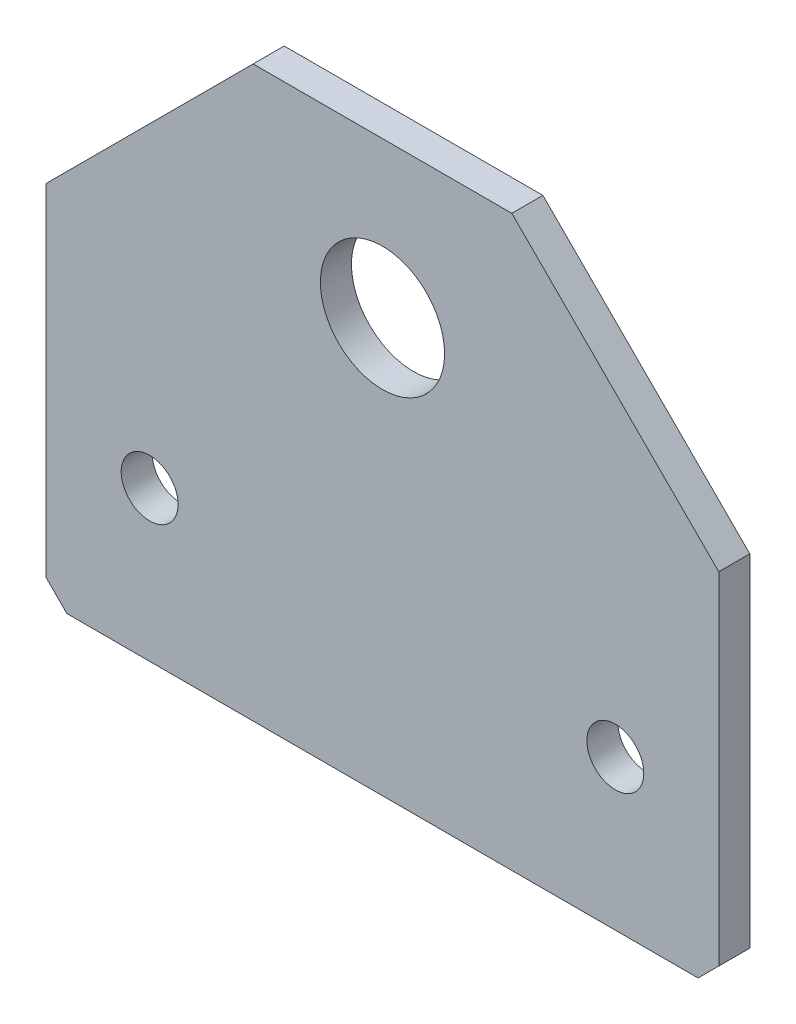
ISO-10303-21;
HEADER;
FILE_DESCRIPTION(('STEP AP214'),'2;1');
FILE_NAME('part.step','',(''),(''),'','','');
FILE_SCHEMA(('AUTOMOTIVE_DESIGN { 1 0 10303 214 1 1 1 1 }'));
ENDSEC;
DATA;
#1=APPLICATION_CONTEXT('core data for automotive mechanical design processes');
#2=APPLICATION_PROTOCOL_DEFINITION('international standard','automotive_design',2000,#1);
#3=PRODUCT_CONTEXT('',#1,'mechanical');
#4=PRODUCT('Part','Part','',(#3));
#5=PRODUCT_RELATED_PRODUCT_CATEGORY('part','',(#4));
#6=PRODUCT_DEFINITION_FORMATION('','',#4);
#7=PRODUCT_DEFINITION_CONTEXT('part definition',#1,'design');
#8=PRODUCT_DEFINITION('design','',#6,#7);
#9=PRODUCT_DEFINITION_SHAPE('','',#8);
#10=(LENGTH_UNIT() NAMED_UNIT(*) SI_UNIT(.MILLI.,.METRE.));
#11=(NAMED_UNIT(*) PLANE_ANGLE_UNIT() SI_UNIT($,.RADIAN.));
#12=(NAMED_UNIT(*) SI_UNIT($,.STERADIAN.) SOLID_ANGLE_UNIT());
#13=UNCERTAINTY_MEASURE_WITH_UNIT(LENGTH_MEASURE(1.E-05),#10,'distance_accuracy_value','');
#14=(GEOMETRIC_REPRESENTATION_CONTEXT(3) GLOBAL_UNCERTAINTY_ASSIGNED_CONTEXT((#13)) GLOBAL_UNIT_ASSIGNED_CONTEXT((#10,
#11,#12)) REPRESENTATION_CONTEXT('',''));
#15=CARTESIAN_POINT('',(0.,0.,0.));
#16=DIRECTION('',(0.,0.,1.));
#17=DIRECTION('',(1.,0.,0.));
#18=AXIS2_PLACEMENT_3D('',#15,#16,#17);
#19=CARTESIAN_POINT('',(0.,-30.4999999999999,3.));
#20=DIRECTION('',(0.,0.,-1.));
#21=DIRECTION('',(-1.,0.,0.));
#22=AXIS2_PLACEMENT_3D('',#19,#20,#21);
#23=PLANE('',#22);
#24=CARTESIAN_POINT('',(-22.5,14.5,3.));
#25=DIRECTION('',(0.,0.,1.));
#26=DIRECTION('',(1.,0.,0.));
#27=AXIS2_PLACEMENT_3D('',#24,#25,#26);
#28=CIRCLE('',#27,2.75);
#29=CARTESIAN_POINT('',(-19.75,14.5,3.));
#30=VERTEX_POINT('',#29);
#31=EDGE_CURVE('E199',#30,#30,#28,.T.);
#32=ORIENTED_EDGE('',*,*,#31,.F.);
#33=EDGE_LOOP('',(#32));
#34=FACE_BOUND('',#33,.T.);
#35=CARTESIAN_POINT('',(22.5,14.5,3.));
#36=DIRECTION('',(0.,0.,1.));
#37=DIRECTION('',(1.,0.,0.));
#38=AXIS2_PLACEMENT_3D('',#35,#36,#37);
#39=CIRCLE('',#38,2.75);
#40=CARTESIAN_POINT('',(25.25,14.5,3.));
#41=VERTEX_POINT('',#40);
#42=EDGE_CURVE('E193',#41,#41,#39,.T.);
#43=ORIENTED_EDGE('',*,*,#42,.F.);
#44=EDGE_LOOP('',(#43));
#45=FACE_BOUND('',#44,.T.);
#46=DIRECTION('',(0.707106781186549,-0.707106781186546,0.));
#47=VECTOR('',#46,1.);
#48=CARTESIAN_POINT('',(-32.5,1.99999999999999,3.));
#49=LINE('',#48,#47);
#50=CARTESIAN_POINT('',(-32.5,1.99999999999999,3.));
#51=VERTEX_POINT('',#50);
#52=CARTESIAN_POINT('',(-30.5,0.,3.));
#53=VERTEX_POINT('',#52);
#54=EDGE_CURVE('E151',#51,#53,#49,.T.);
#55=ORIENTED_EDGE('',*,*,#54,.T.);
#56=DIRECTION('',(1.,0.,0.));
#57=VECTOR('',#56,1.);
#58=CARTESIAN_POINT('',(-30.5,0.,3.));
#59=LINE('',#58,#57);
#60=CARTESIAN_POINT('',(30.5,0.,3.));
#61=VERTEX_POINT('',#60);
#62=EDGE_CURVE('E99',#53,#61,#59,.T.);
#63=ORIENTED_EDGE('',*,*,#62,.T.);
#64=DIRECTION('',(0.707106781186548,0.707106781186547,0.));
#65=VECTOR('',#64,1.);
#66=CARTESIAN_POINT('',(32.5,2.,3.));
#67=LINE('',#66,#65);
#68=CARTESIAN_POINT('',(32.5,2.,3.));
#69=VERTEX_POINT('',#68);
#70=EDGE_CURVE('E166',#61,#69,#67,.T.);
#71=ORIENTED_EDGE('',*,*,#70,.T.);
#72=DIRECTION('',(0.,1.,0.));
#73=VECTOR('',#72,1.);
#74=CARTESIAN_POINT('',(32.5,2.,3.));
#75=LINE('',#74,#73);
#76=CARTESIAN_POINT('',(32.5,35.,3.));
#77=VERTEX_POINT('',#76);
#78=EDGE_CURVE('E179',#69,#77,#75,.T.);
#79=ORIENTED_EDGE('',*,*,#78,.T.);
#80=DIRECTION('',(-0.707106781186548,0.707106781186547,0.));
#81=VECTOR('',#80,1.);
#82=CARTESIAN_POINT('',(12.5,55.,3.));
#83=LINE('',#82,#81);
#84=CARTESIAN_POINT('',(12.5,55.,3.));
#85=VERTEX_POINT('',#84);
#86=EDGE_CURVE('E118',#77,#85,#83,.T.);
#87=ORIENTED_EDGE('',*,*,#86,.T.);
#88=DIRECTION('',(-1.,0.,0.));
#89=VECTOR('',#88,1.);
#90=CARTESIAN_POINT('',(-12.5,55.,3.));
#91=LINE('',#90,#89);
#92=CARTESIAN_POINT('',(-12.5,55.,3.));
#93=VERTEX_POINT('',#92);
#94=EDGE_CURVE('E112',#85,#93,#91,.T.);
#95=ORIENTED_EDGE('',*,*,#94,.T.);
#96=DIRECTION('',(-0.707106781186548,-0.707106781186547,0.));
#97=VECTOR('',#96,1.);
#98=CARTESIAN_POINT('',(-12.5,55.,3.));
#99=LINE('',#98,#97);
#100=CARTESIAN_POINT('',(-32.5,35.,3.));
#101=VERTEX_POINT('',#100);
#102=EDGE_CURVE('E116',#93,#101,#99,.T.);
#103=ORIENTED_EDGE('',*,*,#102,.T.);
#104=DIRECTION('',(0.,-1.,0.));
#105=VECTOR('',#104,1.);
#106=CARTESIAN_POINT('',(-32.5,1.99999999999999,3.));
#107=LINE('',#106,#105);
#108=EDGE_CURVE('E56',#101,#51,#107,.T.);
#109=ORIENTED_EDGE('',*,*,#108,.T.);
#110=EDGE_LOOP('',(#55,#63,#71,#79,#87,#95,#103,#109));
#111=FACE_BOUND('',#110,.T.);
#112=CARTESIAN_POINT('',(0.,40.,3.));
#113=DIRECTION('',(0.,0.,1.));
#114=DIRECTION('',(1.,0.,0.));
#115=AXIS2_PLACEMENT_3D('',#112,#113,#114);
#116=CIRCLE('',#115,6.);
#117=CARTESIAN_POINT('',(6.,40.,3.));
#118=VERTEX_POINT('',#117);
#119=EDGE_CURVE('E140',#118,#118,#116,.T.);
#120=ORIENTED_EDGE('',*,*,#119,.F.);
#121=EDGE_LOOP('',(#120));
#122=FACE_BOUND('',#121,.T.);
#123=ADVANCED_FACE('F39',(#34,#45,#111,#122),#23,.F.);
#124=CARTESIAN_POINT('',(0.,-30.4999999999999,0.));
#125=DIRECTION('',(0.,0.,-1.));
#126=DIRECTION('',(-1.,0.,0.));
#127=AXIS2_PLACEMENT_3D('',#124,#125,#126);
#128=PLANE('',#127);
#129=CARTESIAN_POINT('',(-22.5,14.5,0.));
#130=DIRECTION('',(0.,0.,1.));
#131=DIRECTION('',(1.,0.,0.));
#132=AXIS2_PLACEMENT_3D('',#129,#130,#131);
#133=CIRCLE('',#132,2.75);
#134=CARTESIAN_POINT('',(-19.75,14.5,0.));
#135=VERTEX_POINT('',#134);
#136=EDGE_CURVE('E196',#135,#135,#133,.T.);
#137=ORIENTED_EDGE('',*,*,#136,.T.);
#138=EDGE_LOOP('',(#137));
#139=FACE_BOUND('',#138,.T.);
#140=CARTESIAN_POINT('',(22.5,14.5,0.));
#141=DIRECTION('',(0.,0.,1.));
#142=DIRECTION('',(1.,0.,0.));
#143=AXIS2_PLACEMENT_3D('',#140,#141,#142);
#144=CIRCLE('',#143,2.75);
#145=CARTESIAN_POINT('',(25.25,14.5,0.));
#146=VERTEX_POINT('',#145);
#147=EDGE_CURVE('E188',#146,#146,#144,.T.);
#148=ORIENTED_EDGE('',*,*,#147,.T.);
#149=EDGE_LOOP('',(#148));
#150=FACE_BOUND('',#149,.T.);
#151=DIRECTION('',(0.707106781186549,-0.707106781186546,0.));
#152=VECTOR('',#151,1.);
#153=CARTESIAN_POINT('',(-32.5,1.99999999999999,0.));
#154=LINE('',#153,#152);
#155=CARTESIAN_POINT('',(-32.5,1.99999999999999,0.));
#156=VERTEX_POINT('',#155);
#157=CARTESIAN_POINT('',(-30.5,0.,0.));
#158=VERTEX_POINT('',#157);
#159=EDGE_CURVE('E136',#156,#158,#154,.T.);
#160=ORIENTED_EDGE('',*,*,#159,.F.);
#161=DIRECTION('',(0.,-1.,0.));
#162=VECTOR('',#161,1.);
#163=CARTESIAN_POINT('',(-32.5,1.99999999999999,0.));
#164=LINE('',#163,#162);
#165=CARTESIAN_POINT('',(-32.5,35.,0.));
#166=VERTEX_POINT('',#165);
#167=EDGE_CURVE('E91',#166,#156,#164,.T.);
#168=ORIENTED_EDGE('',*,*,#167,.F.);
#169=DIRECTION('',(-0.707106781186548,-0.707106781186547,0.));
#170=VECTOR('',#169,1.);
#171=CARTESIAN_POINT('',(-12.5,55.,0.));
#172=LINE('',#171,#170);
#173=CARTESIAN_POINT('',(-12.5,55.,0.));
#174=VERTEX_POINT('',#173);
#175=EDGE_CURVE('E85',#174,#166,#172,.T.);
#176=ORIENTED_EDGE('',*,*,#175,.F.);
#177=DIRECTION('',(-1.,0.,0.));
#178=VECTOR('',#177,1.);
#179=CARTESIAN_POINT('',(-12.5,55.,0.));
#180=LINE('',#179,#178);
#181=CARTESIAN_POINT('',(12.5,55.,0.));
#182=VERTEX_POINT('',#181);
#183=EDGE_CURVE('E126',#182,#174,#180,.T.);
#184=ORIENTED_EDGE('',*,*,#183,.F.);
#185=DIRECTION('',(-0.707106781186548,0.707106781186547,0.));
#186=VECTOR('',#185,1.);
#187=CARTESIAN_POINT('',(12.5,55.,0.));
#188=LINE('',#187,#186);
#189=CARTESIAN_POINT('',(32.5,35.,0.));
#190=VERTEX_POINT('',#189);
#191=EDGE_CURVE('E146',#190,#182,#188,.T.);
#192=ORIENTED_EDGE('',*,*,#191,.F.);
#193=DIRECTION('',(0.,1.,0.));
#194=VECTOR('',#193,1.);
#195=CARTESIAN_POINT('',(32.5,2.,0.));
#196=LINE('',#195,#194);
#197=CARTESIAN_POINT('',(32.5,2.,0.));
#198=VERTEX_POINT('',#197);
#199=EDGE_CURVE('E144',#198,#190,#196,.T.);
#200=ORIENTED_EDGE('',*,*,#199,.F.);
#201=DIRECTION('',(0.707106781186548,0.707106781186547,0.));
#202=VECTOR('',#201,1.);
#203=CARTESIAN_POINT('',(32.5,2.,0.));
#204=LINE('',#203,#202);
#205=CARTESIAN_POINT('',(30.5,0.,0.));
#206=VERTEX_POINT('',#205);
#207=EDGE_CURVE('E142',#206,#198,#204,.T.);
#208=ORIENTED_EDGE('',*,*,#207,.F.);
#209=DIRECTION('',(1.,0.,0.));
#210=VECTOR('',#209,1.);
#211=CARTESIAN_POINT('',(-30.5,0.,0.));
#212=LINE('',#211,#210);
#213=EDGE_CURVE('E139',#158,#206,#212,.T.);
#214=ORIENTED_EDGE('',*,*,#213,.F.);
#215=EDGE_LOOP('',(#160,#168,#176,#184,#192,#200,#208,#214));
#216=FACE_BOUND('',#215,.T.);
#217=CARTESIAN_POINT('',(0.,40.,0.));
#218=DIRECTION('',(0.,0.,1.));
#219=DIRECTION('',(1.,0.,0.));
#220=AXIS2_PLACEMENT_3D('',#217,#218,#219);
#221=CIRCLE('',#220,6.);
#222=CARTESIAN_POINT('',(6.,40.,0.));
#223=VERTEX_POINT('',#222);
#224=EDGE_CURVE('E185',#223,#223,#221,.T.);
#225=ORIENTED_EDGE('',*,*,#224,.T.);
#226=EDGE_LOOP('',(#225));
#227=FACE_BOUND('',#226,.T.);
#228=ADVANCED_FACE('F170',(#139,#150,#216,#227),#128,.T.);
#229=CARTESIAN_POINT('',(-32.5,1.99999999999999,3.));
#230=DIRECTION('',(0.707106781186546,0.707106781186549,0.));
#231=DIRECTION('',(-0.707106781186549,0.707106781186546,0.));
#232=AXIS2_PLACEMENT_3D('',#229,#230,#231);
#233=PLANE('',#232);
#234=ORIENTED_EDGE('',*,*,#159,.T.);
#235=DIRECTION('',(0.,0.,-1.));
#236=VECTOR('',#235,1.);
#237=CARTESIAN_POINT('',(-30.5,0.,3.));
#238=LINE('',#237,#236);
#239=EDGE_CURVE('E11',#53,#158,#238,.T.);
#240=ORIENTED_EDGE('',*,*,#239,.F.);
#241=ORIENTED_EDGE('',*,*,#54,.F.);
#242=DIRECTION('',(0.,0.,-1.));
#243=VECTOR('',#242,1.);
#244=CARTESIAN_POINT('',(-32.5,1.99999999999999,3.));
#245=LINE('',#244,#243);
#246=EDGE_CURVE('E132',#51,#156,#245,.T.);
#247=ORIENTED_EDGE('',*,*,#246,.T.);
#248=EDGE_LOOP('',(#234,#240,#241,#247));
#249=FACE_BOUND('',#248,.T.);
#250=ADVANCED_FACE('F41',(#249),#233,.F.);
#251=CARTESIAN_POINT('',(-30.5,0.,3.));
#252=DIRECTION('',(0.,1.,0.));
#253=DIRECTION('',(0.,0.,1.));
#254=AXIS2_PLACEMENT_3D('',#251,#252,#253);
#255=PLANE('',#254);
#256=ORIENTED_EDGE('',*,*,#213,.T.);
#257=DIRECTION('',(0.,0.,-1.));
#258=VECTOR('',#257,1.);
#259=CARTESIAN_POINT('',(30.5,0.,3.));
#260=LINE('',#259,#258);
#261=EDGE_CURVE('E48',#61,#206,#260,.T.);
#262=ORIENTED_EDGE('',*,*,#261,.F.);
#263=ORIENTED_EDGE('',*,*,#62,.F.);
#264=ORIENTED_EDGE('',*,*,#239,.T.);
#265=EDGE_LOOP('',(#256,#262,#263,#264));
#266=FACE_BOUND('',#265,.T.);
#267=ADVANCED_FACE('F240',(#266),#255,.F.);
#268=CARTESIAN_POINT('',(32.5,2.,3.));
#269=DIRECTION('',(-0.707106781186547,0.707106781186548,0.));
#270=DIRECTION('',(-0.707106781186548,-0.707106781186547,0.));
#271=AXIS2_PLACEMENT_3D('',#268,#269,#270);
#272=PLANE('',#271);
#273=ORIENTED_EDGE('',*,*,#207,.T.);
#274=DIRECTION('',(0.,0.,-1.));
#275=VECTOR('',#274,1.);
#276=CARTESIAN_POINT('',(32.5,2.,3.));
#277=LINE('',#276,#275);
#278=EDGE_CURVE('E158',#69,#198,#277,.T.);
#279=ORIENTED_EDGE('',*,*,#278,.F.);
#280=ORIENTED_EDGE('',*,*,#70,.F.);
#281=ORIENTED_EDGE('',*,*,#261,.T.);
#282=EDGE_LOOP('',(#273,#279,#280,#281));
#283=FACE_BOUND('',#282,.T.);
#284=ADVANCED_FACE('F164',(#283),#272,.F.);
#285=CARTESIAN_POINT('',(32.5,2.,3.));
#286=DIRECTION('',(-1.,0.,0.));
#287=DIRECTION('',(0.,-1.,0.));
#288=AXIS2_PLACEMENT_3D('',#285,#286,#287);
#289=PLANE('',#288);
#290=ORIENTED_EDGE('',*,*,#199,.T.);
#291=DIRECTION('',(0.,0.,-1.));
#292=VECTOR('',#291,1.);
#293=CARTESIAN_POINT('',(32.5,35.,3.));
#294=LINE('',#293,#292);
#295=EDGE_CURVE('E155',#77,#190,#294,.T.);
#296=ORIENTED_EDGE('',*,*,#295,.F.);
#297=ORIENTED_EDGE('',*,*,#78,.F.);
#298=ORIENTED_EDGE('',*,*,#278,.T.);
#299=EDGE_LOOP('',(#290,#296,#297,#298));
#300=FACE_BOUND('',#299,.T.);
#301=ADVANCED_FACE('F175',(#300),#289,.F.);
#302=CARTESIAN_POINT('',(12.5,55.,3.));
#303=DIRECTION('',(-0.707106781186547,-0.707106781186548,0.));
#304=DIRECTION('',(0.707106781186548,-0.707106781186547,0.));
#305=AXIS2_PLACEMENT_3D('',#302,#303,#304);
#306=PLANE('',#305);
#307=ORIENTED_EDGE('',*,*,#191,.T.);
#308=DIRECTION('',(0.,0.,-1.));
#309=VECTOR('',#308,1.);
#310=CARTESIAN_POINT('',(12.5,55.,3.));
#311=LINE('',#310,#309);
#312=EDGE_CURVE('E127',#85,#182,#311,.T.);
#313=ORIENTED_EDGE('',*,*,#312,.F.);
#314=ORIENTED_EDGE('',*,*,#86,.F.);
#315=ORIENTED_EDGE('',*,*,#295,.T.);
#316=EDGE_LOOP('',(#307,#313,#314,#315));
#317=FACE_BOUND('',#316,.T.);
#318=ADVANCED_FACE('F178',(#317),#306,.F.);
#319=CARTESIAN_POINT('',(-12.5,55.,3.));
#320=DIRECTION('',(0.,-1.,0.));
#321=DIRECTION('',(0.,0.,-1.));
#322=AXIS2_PLACEMENT_3D('',#319,#320,#321);
#323=PLANE('',#322);
#324=ORIENTED_EDGE('',*,*,#183,.T.);
#325=DIRECTION('',(0.,0.,-1.));
#326=VECTOR('',#325,1.);
#327=CARTESIAN_POINT('',(-12.5,55.,3.));
#328=LINE('',#327,#326);
#329=EDGE_CURVE('E123',#93,#174,#328,.T.);
#330=ORIENTED_EDGE('',*,*,#329,.F.);
#331=ORIENTED_EDGE('',*,*,#94,.F.);
#332=ORIENTED_EDGE('',*,*,#312,.T.);
#333=EDGE_LOOP('',(#324,#330,#331,#332));
#334=FACE_BOUND('',#333,.T.);
#335=ADVANCED_FACE('F124',(#334),#323,.F.);
#336=CARTESIAN_POINT('',(-12.5,55.,3.));
#337=DIRECTION('',(0.707106781186547,-0.707106781186548,0.));
#338=DIRECTION('',(0.707106781186548,0.707106781186547,0.));
#339=AXIS2_PLACEMENT_3D('',#336,#337,#338);
#340=PLANE('',#339);
#341=ORIENTED_EDGE('',*,*,#175,.T.);
#342=DIRECTION('',(0.,0.,-1.));
#343=VECTOR('',#342,1.);
#344=CARTESIAN_POINT('',(-32.5,35.,3.));
#345=LINE('',#344,#343);
#346=EDGE_CURVE('E128',#101,#166,#345,.T.);
#347=ORIENTED_EDGE('',*,*,#346,.F.);
#348=ORIENTED_EDGE('',*,*,#102,.F.);
#349=ORIENTED_EDGE('',*,*,#329,.T.);
#350=EDGE_LOOP('',(#341,#347,#348,#349));
#351=FACE_BOUND('',#350,.T.);
#352=ADVANCED_FACE('F130',(#351),#340,.F.);
#353=CARTESIAN_POINT('',(-32.5,1.99999999999999,3.));
#354=DIRECTION('',(1.,0.,0.));
#355=DIRECTION('',(0.,1.,0.));
#356=AXIS2_PLACEMENT_3D('',#353,#354,#355);
#357=PLANE('',#356);
#358=ORIENTED_EDGE('',*,*,#167,.T.);
#359=ORIENTED_EDGE('',*,*,#246,.F.);
#360=ORIENTED_EDGE('',*,*,#108,.F.);
#361=ORIENTED_EDGE('',*,*,#346,.T.);
#362=EDGE_LOOP('',(#358,#359,#360,#361));
#363=FACE_BOUND('',#362,.T.);
#364=ADVANCED_FACE('F222',(#363),#357,.F.);
#365=CARTESIAN_POINT('',(0.,40.,3.));
#366=DIRECTION('',(0.,0.,-1.));
#367=DIRECTION('',(-1.,0.,0.));
#368=AXIS2_PLACEMENT_3D('',#365,#366,#367);
#369=CYLINDRICAL_SURFACE('',#368,6.);
#370=ORIENTED_EDGE('',*,*,#119,.T.);
#371=EDGE_LOOP('',(#370));
#372=FACE_BOUND('',#371,.T.);
#373=ORIENTED_EDGE('',*,*,#224,.F.);
#374=EDGE_LOOP('',(#373));
#375=FACE_BOUND('',#374,.T.);
#376=ADVANCED_FACE('F212',(#372,#375),#369,.F.);
#377=CARTESIAN_POINT('',(22.5,14.5,3.));
#378=DIRECTION('',(0.,0.,1.));
#379=DIRECTION('',(1.,0.,0.));
#380=AXIS2_PLACEMENT_3D('',#377,#378,#379);
#381=CYLINDRICAL_SURFACE('',#380,2.75);
#382=ORIENTED_EDGE('',*,*,#147,.F.);
#383=EDGE_LOOP('',(#382));
#384=FACE_BOUND('',#383,.T.);
#385=ORIENTED_EDGE('',*,*,#42,.T.);
#386=EDGE_LOOP('',(#385));
#387=FACE_BOUND('',#386,.T.);
#388=ADVANCED_FACE('F210',(#384,#387),#381,.F.);
#389=CARTESIAN_POINT('',(-22.5,14.5,3.));
#390=DIRECTION('',(0.,0.,1.));
#391=DIRECTION('',(1.,0.,0.));
#392=AXIS2_PLACEMENT_3D('',#389,#390,#391);
#393=CYLINDRICAL_SURFACE('',#392,2.75);
#394=ORIENTED_EDGE('',*,*,#136,.F.);
#395=EDGE_LOOP('',(#394));
#396=FACE_BOUND('',#395,.T.);
#397=ORIENTED_EDGE('',*,*,#31,.T.);
#398=EDGE_LOOP('',(#397));
#399=FACE_BOUND('',#398,.T.);
#400=ADVANCED_FACE('F203',(#396,#399),#393,.F.);
#401=CLOSED_SHELL('',(#123,#228,#250,#267,#284,#301,#318,#335,#352,#364,#376,#388,#400));
#402=MANIFOLD_SOLID_BREP('B2',#401);
#403=ADVANCED_BREP_SHAPE_REPRESENTATION('',(#18,#402),#14);
#404=SHAPE_DEFINITION_REPRESENTATION(#9,#403);
ENDSEC;
END-ISO-10303-21;
